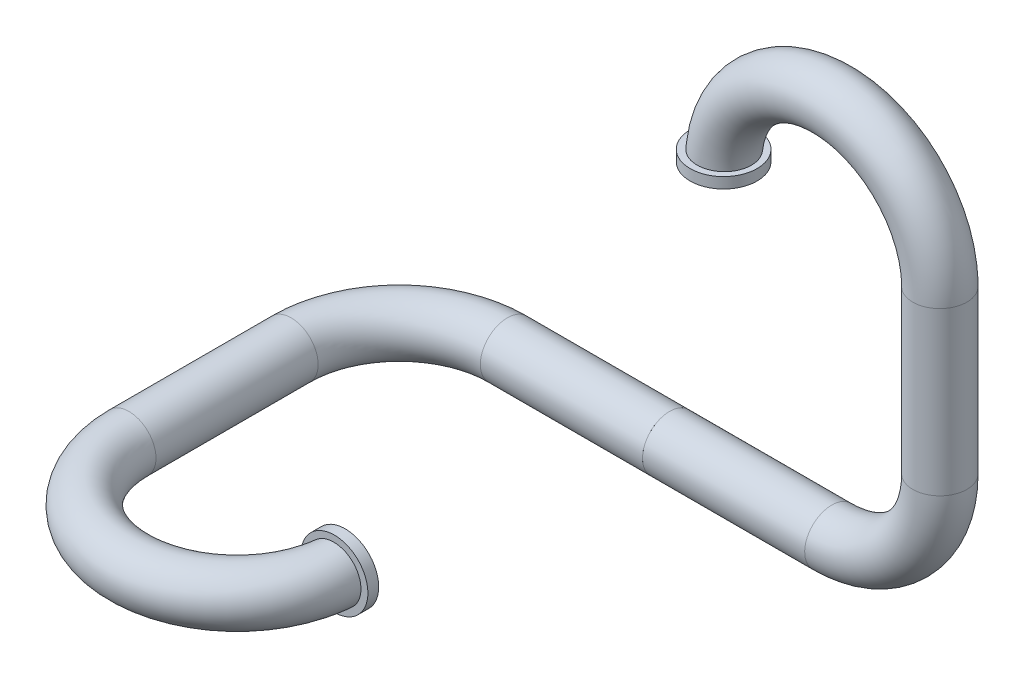
ISO-10303-21;
HEADER;
FILE_DESCRIPTION(('STEP AP214'),'2;1');
FILE_NAME('part.step','',(''),(''),'','','');
FILE_SCHEMA(('AUTOMOTIVE_DESIGN { 1 0 10303 214 1 1 1 1 }'));
ENDSEC;
DATA;
#1=APPLICATION_CONTEXT('core data for automotive mechanical design processes');
#2=APPLICATION_PROTOCOL_DEFINITION('international standard','automotive_design',2000,#1);
#3=PRODUCT_CONTEXT('',#1,'mechanical');
#4=PRODUCT('Part','Part','',(#3));
#5=PRODUCT_RELATED_PRODUCT_CATEGORY('part','',(#4));
#6=PRODUCT_DEFINITION_FORMATION('','',#4);
#7=PRODUCT_DEFINITION_CONTEXT('part definition',#1,'design');
#8=PRODUCT_DEFINITION('design','',#6,#7);
#9=PRODUCT_DEFINITION_SHAPE('','',#8);
#10=(LENGTH_UNIT() NAMED_UNIT(*) SI_UNIT(.MILLI.,.METRE.));
#11=(NAMED_UNIT(*) PLANE_ANGLE_UNIT() SI_UNIT($,.RADIAN.));
#12=(NAMED_UNIT(*) SI_UNIT($,.STERADIAN.) SOLID_ANGLE_UNIT());
#13=UNCERTAINTY_MEASURE_WITH_UNIT(LENGTH_MEASURE(1.E-05),#10,'distance_accuracy_value','');
#14=(GEOMETRIC_REPRESENTATION_CONTEXT(3) GLOBAL_UNCERTAINTY_ASSIGNED_CONTEXT((#13)) GLOBAL_UNIT_ASSIGNED_CONTEXT((#10,
#11,#12)) REPRESENTATION_CONTEXT('',''));
#15=CARTESIAN_POINT('',(0.,0.,0.));
#16=DIRECTION('',(0.,0.,1.));
#17=DIRECTION('',(1.,0.,0.));
#18=AXIS2_PLACEMENT_3D('',#15,#16,#17);
#19=CARTESIAN_POINT('',(0.5,-2.50000000000001,2.5));
#20=DIRECTION('',(1.,0.,0.));
#21=DIRECTION('',(0.,1.,0.));
#22=AXIS2_PLACEMENT_3D('',#19,#20,#21);
#23=PLANE('',#22);
#24=CARTESIAN_POINT('',(0.5,-2.5,0.));
#25=DIRECTION('',(1.,0.,0.));
#26=DIRECTION('',(0.,1.,0.));
#27=AXIS2_PLACEMENT_3D('',#24,#25,#26);
#28=CIRCLE('',#27,0.2);
#29=CARTESIAN_POINT('',(0.5,-2.3,0.));
#30=VERTEX_POINT('',#29);
#31=EDGE_CURVE('E42',#30,#30,#28,.F.);
#32=ORIENTED_EDGE('',*,*,#31,.T.);
#33=EDGE_LOOP('',(#32));
#34=FACE_BOUND('',#33,.T.);
#35=CARTESIAN_POINT('',(0.5,-2.5,0.));
#36=DIRECTION('',(1.,0.,0.));
#37=DIRECTION('',(0.,1.,0.));
#38=AXIS2_PLACEMENT_3D('',#35,#36,#37);
#39=CIRCLE('',#38,0.25);
#40=CARTESIAN_POINT('',(0.5,-2.25,0.));
#41=VERTEX_POINT('',#40);
#42=EDGE_CURVE('E56',#41,#41,#39,.F.);
#43=ORIENTED_EDGE('',*,*,#42,.F.);
#44=EDGE_LOOP('',(#43));
#45=FACE_BOUND('',#44,.T.);
#46=ADVANCED_FACE('F38',(#34,#45),#23,.T.);
#47=CARTESIAN_POINT('',(0.,-2.50000000000001,2.6));
#48=DIRECTION('',(0.,0.,-1.));
#49=DIRECTION('',(0.,1.,0.));
#50=AXIS2_PLACEMENT_3D('',#47,#48,#49);
#51=CYLINDRICAL_SURFACE('',#50,0.31);
#52=CARTESIAN_POINT('',(0.,-2.50000000000001,2.6));
#53=DIRECTION('',(0.,0.,1.));
#54=DIRECTION('',(0.,-1.,0.));
#55=AXIS2_PLACEMENT_3D('',#52,#53,#54);
#56=CIRCLE('',#55,0.31);
#57=CARTESIAN_POINT('',(0.,-2.81000000000001,2.6));
#58=VERTEX_POINT('',#57);
#59=EDGE_CURVE('E46',#58,#58,#56,.T.);
#60=ORIENTED_EDGE('',*,*,#59,.F.);
#61=EDGE_LOOP('',(#60));
#62=FACE_BOUND('',#61,.T.);
#63=CARTESIAN_POINT('',(0.,-2.50000000000001,2.5));
#64=DIRECTION('',(0.,0.,1.));
#65=DIRECTION('',(0.,-1.,0.));
#66=AXIS2_PLACEMENT_3D('',#63,#64,#65);
#67=CIRCLE('',#66,0.31);
#68=CARTESIAN_POINT('',(0.,-2.81000000000001,2.5));
#69=VERTEX_POINT('',#68);
#70=EDGE_CURVE('E11',#69,#69,#67,.T.);
#71=ORIENTED_EDGE('',*,*,#70,.T.);
#72=EDGE_LOOP('',(#71));
#73=FACE_BOUND('',#72,.T.);
#74=ADVANCED_FACE('F82',(#62,#73),#51,.T.);
#75=CARTESIAN_POINT('',(0.,-2.50000000000001,2.6));
#76=DIRECTION('',(0.,0.,1.));
#77=DIRECTION('',(0.,-1.,0.));
#78=AXIS2_PLACEMENT_3D('',#75,#76,#77);
#79=PLANE('',#78);
#80=ORIENTED_EDGE('',*,*,#59,.T.);
#81=EDGE_LOOP('',(#80));
#82=FACE_BOUND('',#81,.T.);
#83=CARTESIAN_POINT('',(-0.201401096317609,-2.34376036206095,2.6));
#84=CARTESIAN_POINT('',(-0.210190615714738,-2.3546555316644,2.6));
#85=CARTESIAN_POINT('',(-0.218071722109463,-2.36629603769943,2.6));
#86=CARTESIAN_POINT('',(-0.231777903107573,-2.39074262085692,2.6));
#87=CARTESIAN_POINT('',(-0.237600690405998,-2.40354997489217,2.6));
#88=CARTESIAN_POINT('',(-0.247007650165607,-2.42996134021037,2.6));
#89=CARTESIAN_POINT('',(-0.250592194362358,-2.44356521879289,2.6));
#90=CARTESIAN_POINT('',(-0.255413188399921,-2.47117935384267,2.6));
#91=CARTESIAN_POINT('',(-0.256650230465359,-2.4851895069098,2.6));
#92=CARTESIAN_POINT('',(-0.25674012956133,-2.51315381103875,2.6));
#93=CARTESIAN_POINT('',(-0.255603761287644,-2.527107928297,2.6));
#94=CARTESIAN_POINT('',(-0.251003172674125,-2.55462721374323,2.6));
#95=CARTESIAN_POINT('',(-0.247538882318156,-2.56819237021977,2.6));
#96=CARTESIAN_POINT('',(-0.238388633745031,-2.59454538926489,2.6));
#97=CARTESIAN_POINT('',(-0.232703487129412,-2.60733353381829,2.6));
#98=CARTESIAN_POINT('',(-0.219279773062284,-2.63178209678148,2.6));
#99=CARTESIAN_POINT('',(-0.211541147629265,-2.64344248333549,2.6));
#100=CARTESIAN_POINT('',(-0.194180832606932,-2.66538311643699,2.6));
#101=CARTESIAN_POINT('',(-0.18454778916345,-2.67565437808356,2.6));
#102=CARTESIAN_POINT('',(-0.163705864908683,-2.69444931498862,2.6));
#103=CARTESIAN_POINT('',(-0.152496920871618,-2.70297292009667,2.6));
#104=CARTESIAN_POINT('',(-0.128727432177818,-2.71809849586688,2.6));
#105=CARTESIAN_POINT('',(-0.116157110459005,-2.72468510480363,2.6));
#106=CARTESIAN_POINT('',(-0.090092558295824,-2.73566542576813,2.6));
#107=CARTESIAN_POINT('',(-0.0765983014200872,-2.7400590750312,2.6));
#108=CARTESIAN_POINT('',(-0.0490037254832951,-2.74654519119286,2.6));
#109=CARTESIAN_POINT('',(-0.0349009697958583,-2.74862729772805,2.6));
#110=CARTESIAN_POINT('',(-0.0065459349688668,-2.75039444716182,2.6));
#111=CARTESIAN_POINT('',(0.00770634481024823,-2.75007947980322,2.6));
#112=CARTESIAN_POINT('',(0.0359552161641339,-2.74705813940225,2.6));
#113=CARTESIAN_POINT('',(0.0499518104184512,-2.74435179143591,2.6));
#114=CARTESIAN_POINT('',(0.0772894135497917,-2.73662047735946,2.6));
#115=CARTESIAN_POINT('',(0.0906304308904238,-2.73159554119144,2.6));
#116=CARTESIAN_POINT('',(0.116234413487642,-2.71938486900645,2.6));
#117=CARTESIAN_POINT('',(0.128500521169367,-2.71220572285242,2.6));
#118=CARTESIAN_POINT('',(0.151646839119026,-2.69588211387219,2.6));
#119=CARTESIAN_POINT('',(0.162527077997131,-2.68673769162805,2.6));
#120=CARTESIAN_POINT('',(0.182546180432526,-2.66678276640518,2.6));
#121=CARTESIAN_POINT('',(0.191691887715395,-2.65597912907339,2.6));
#122=CARTESIAN_POINT('',(0.208031942604488,-2.63298512264845,2.6));
#123=CARTESIAN_POINT('',(0.215226328920527,-2.62079478107121,2.6));
#124=CARTESIAN_POINT('',(0.227433287128235,-2.59542026293881,2.6));
#125=CARTESIAN_POINT('',(0.232453530620286,-2.58223977665941,2.6));
#126=CARTESIAN_POINT('',(0.240204253167929,-2.55522194484153,2.6));
#127=CARTESIAN_POINT('',(0.242934765237328,-2.54138460877667,2.6));
#128=CARTESIAN_POINT('',(0.246023480720513,-2.51347957399531,2.6));
#129=CARTESIAN_POINT('',(0.246387057425578,-2.49941246978034,2.6));
#130=CARTESIAN_POINT('',(0.244745727650856,-2.47141718228088,2.6));
#131=CARTESIAN_POINT('',(0.242740835396257,-2.45748899816253,2.6));
#132=CARTESIAN_POINT('',(0.236422429745385,-2.43017585350137,2.6));
#133=CARTESIAN_POINT('',(0.232110367704181,-2.41679055713653,2.6));
#134=CARTESIAN_POINT('',(0.221302613835048,-2.39093278783442,2.6));
#135=CARTESIAN_POINT('',(0.21480691921559,-2.37846031606413,2.6));
#136=CARTESIAN_POINT('',(0.199809991107809,-2.35476686697339,2.6));
#137=CARTESIAN_POINT('',(0.191306581255811,-2.34354726734438,2.6));
#138=CARTESIAN_POINT('',(0.172541402772618,-2.32269021557873,2.6));
#139=CARTESIAN_POINT('',(0.162279611876264,-2.31305278347899,2.6));
#140=CARTESIAN_POINT('',(0.140260536178512,-2.2956054110259,2.6));
#141=CARTESIAN_POINT('',(0.128499350856914,-2.28780039362167,2.6));
#142=CARTESIAN_POINT('',(0.103837454519992,-2.27426711311745,2.6));
#143=CARTESIAN_POINT('',(0.0909367201277325,-2.26853889263357,2.6));
#144=CARTESIAN_POINT('',(0.0643098227029985,-2.25929834983662,2.6));
#145=CARTESIAN_POINT('',(0.0505807148736024,-2.25579451342965,2.6));
#146=CARTESIAN_POINT('',(0.0227304868784085,-2.25113171827814,2.6));
#147=CARTESIAN_POINT('',(0.00860937300525724,-2.24997272191527,2.6));
#148=CARTESIAN_POINT('',(-0.019682310331464,-2.25002836206515,2.6));
#149=CARTESIAN_POINT('',(-0.033852861838134,-2.25125211594202,2.6));
#150=CARTESIAN_POINT('',(-0.0617929096379456,-2.25605561176457,2.6));
#151=CARTESIAN_POINT('',(-0.0755622983800522,-2.25963597955383,2.6));
#152=CARTESIAN_POINT('',(-0.102345731745449,-2.26906490291857,2.6));
#153=CARTESIAN_POINT('',(-0.115357430686798,-2.27492011201274,2.6));
#154=CARTESIAN_POINT('',(-0.140200186875687,-2.28873081702701,2.6));
#155=CARTESIAN_POINT('',(-0.152032625018917,-2.29668381568912,2.6));
#156=CARTESIAN_POINT('',(-0.170150558895375,-2.31122311793616,2.6));
#157=CARTESIAN_POINT('',(-0.176888616987927,-2.31725492758524,2.6));
#158=CARTESIAN_POINT('',(-0.189677604716015,-2.33000779744646,2.6));
#159=CARTESIAN_POINT('',(-0.195728533355725,-2.33672885865747,2.6));
#160=CARTESIAN_POINT('',(-0.201401096317609,-2.34376036206095,2.6));
#161=B_SPLINE_CURVE_WITH_KNOTS('',3,(#83,#84,#85,#86,#87,#88,#89,#90,#91,#92,#93,#94,#95,#96,
#97,#98,#99,#100,#101,#102,#103,#104,#105,#106,#107,#108,#109,#110,#111,#112,#113,#114,#115,
#116,#117,#118,#119,#120,#121,#122,#123,#124,#125,#126,#127,#128,#129,#130,#131,#132,#133,#134,
#135,#136,#137,#138,#139,#140,#141,#142,#143,#144,#145,#146,#147,#148,#149,#150,#151,#152,#153,
#154,#155,#156,#157,#158,#159,#160),.UNSPECIFIED.,.T.,.F.,(4,2,2,2,2,2,2,2,2,2,2,2,2,2,2,2,2,2,
2,2,2,2,2,2,2,2,2,2,2,2,2,2,2,2,2,2,2,2,4),(0.,0.041963105250393,0.0839726964411995,
0.125975308668973,0.167967323125762,0.209769118662524,0.251572171514233,0.293359961905662,
0.335148932332196,0.377196440897467,0.419245636907758,0.461619835954524,0.503995247723257,
0.54655982933734,0.589124593087473,0.631688910508933,0.6742526782734,0.716687545691694,
0.759121536933535,0.801384450217337,0.843646525038763,0.88575823574167,0.927869339259047,
0.969884810944664,1.01190003028372,1.05388885042508,1.09587772424463,1.13791232469054,
1.17994745743075,1.22209426111071,1.2642419295994,1.30654943795309,1.34885626756106,
1.39132529833847,1.43380561212635,1.47641112039158,1.51896613717817,1.5460481653165,
1.57313023270311),.UNSPECIFIED.);
#162=CARTESIAN_POINT('',(-0.201401096317609,-2.34376036206095,2.6));
#163=VERTEX_POINT('',#162);
#164=EDGE_CURVE('E51',#163,#163,#161,.T.);
#165=ORIENTED_EDGE('',*,*,#164,.F.);
#166=EDGE_LOOP('',(#165));
#167=FACE_BOUND('',#166,.T.);
#168=ADVANCED_FACE('F84',(#82,#167),#79,.T.);
#169=CARTESIAN_POINT('',(-1.,-2.50000000000001,2.5));
#170=DIRECTION('',(0.,1.,0.));
#171=DIRECTION('',(-1.,0.,0.));
#172=AXIS2_PLACEMENT_3D('',#169,#170,#171);
#173=TOROIDAL_SURFACE('',#172,1.,0.25);
#174=ORIENTED_EDGE('',*,*,#164,.T.);
#175=EDGE_LOOP('',(#174));
#176=FACE_BOUND('',#175,.T.);
#177=CARTESIAN_POINT('',(-2.,-2.50000000000001,2.5));
#178=DIRECTION('',(0.,0.,-1.));
#179=DIRECTION('',(1.,0.,0.));
#180=AXIS2_PLACEMENT_3D('',#177,#178,#179);
#181=CIRCLE('',#180,0.25);
#182=CARTESIAN_POINT('',(-1.75,-2.50000000000001,2.5));
#183=VERTEX_POINT('',#182);
#184=EDGE_CURVE('E107',#183,#183,#181,.T.);
#185=ORIENTED_EDGE('',*,*,#184,.F.);
#186=EDGE_LOOP('',(#185));
#187=FACE_BOUND('',#186,.T.);
#188=ADVANCED_FACE('F91',(#176,#187),#173,.T.);
#189=CARTESIAN_POINT('',(-2.,-2.50000000000001,2.5));
#190=DIRECTION('',(0.,0.,-1.));
#191=DIRECTION('',(1.,0.,0.));
#192=AXIS2_PLACEMENT_3D('',#189,#190,#191);
#193=CYLINDRICAL_SURFACE('',#192,0.25);
#194=ORIENTED_EDGE('',*,*,#184,.T.);
#195=EDGE_LOOP('',(#194));
#196=FACE_BOUND('',#195,.T.);
#197=CARTESIAN_POINT('',(-2.,-2.5,1.));
#198=DIRECTION('',(0.,0.,1.));
#199=DIRECTION('',(-1.,0.,0.));
#200=AXIS2_PLACEMENT_3D('',#197,#198,#199);
#201=CIRCLE('',#200,0.25);
#202=CARTESIAN_POINT('',(-2.25,-2.5,1.));
#203=VERTEX_POINT('',#202);
#204=EDGE_CURVE('E62',#203,#203,#201,.F.);
#205=ORIENTED_EDGE('',*,*,#204,.F.);
#206=EDGE_LOOP('',(#205));
#207=FACE_BOUND('',#206,.T.);
#208=ADVANCED_FACE('F112',(#196,#207),#193,.T.);
#209=CARTESIAN_POINT('',(-1.,-2.5,1.));
#210=DIRECTION('',(0.,-1.,0.));
#211=DIRECTION('',(1.,0.,0.));
#212=AXIS2_PLACEMENT_3D('',#209,#210,#211);
#213=TOROIDAL_SURFACE('',#212,1.,0.25);
#214=CARTESIAN_POINT('',(-1.,-2.5,0.));
#215=DIRECTION('',(1.,0.,0.));
#216=DIRECTION('',(0.,0.,1.));
#217=AXIS2_PLACEMENT_3D('',#214,#215,#216);
#218=CIRCLE('',#217,0.25);
#219=CARTESIAN_POINT('',(-1.,-2.5,-0.25));
#220=VERTEX_POINT('',#219);
#221=EDGE_CURVE('E58',#220,#220,#218,.T.);
#222=CARTESIAN_POINT('',(-1.,-2.5,1.));
#223=DIRECTION('',(0.,-1.,0.));
#224=DIRECTION('',(1.,0.,0.));
#225=AXIS2_PLACEMENT_3D('',#222,#223,#224);
#226=CIRCLE('',#225,1.25);
#227=EDGE_CURVE('',#203,#220,#226,.T.);
#228=ORIENTED_EDGE('',*,*,#204,.T.);
#229=ORIENTED_EDGE('',*,*,#221,.F.);
#230=ORIENTED_EDGE('',*,*,#227,.T.);
#231=ORIENTED_EDGE('',*,*,#227,.F.);
#232=EDGE_LOOP('',(#228,#230,#229,#231));
#233=FACE_BOUND('',#232,.T.);
#234=ADVANCED_FACE('F116',(#233),#213,.T.);
#235=CARTESIAN_POINT('',(0.,-2.50000000000001,2.5));
#236=DIRECTION('',(0.,0.,1.));
#237=DIRECTION('',(0.,-1.,0.));
#238=AXIS2_PLACEMENT_3D('',#235,#236,#237);
#239=PLANE('',#238);
#240=CARTESIAN_POINT('',(0.,-2.50000000000001,2.5));
#241=DIRECTION('',(0.,0.,1.));
#242=DIRECTION('',(0.,-1.,0.));
#243=AXIS2_PLACEMENT_3D('',#240,#241,#242);
#244=CIRCLE('',#243,0.2);
#245=CARTESIAN_POINT('',(0.2,-2.50000000000001,2.5));
#246=VERTEX_POINT('',#245);
#247=EDGE_CURVE('E54',#246,#246,#244,.T.);
#248=ORIENTED_EDGE('',*,*,#247,.T.);
#249=EDGE_LOOP('',(#248));
#250=FACE_BOUND('',#249,.T.);
#251=ORIENTED_EDGE('',*,*,#70,.F.);
#252=EDGE_LOOP('',(#251));
#253=FACE_BOUND('',#252,.T.);
#254=ADVANCED_FACE('F120',(#250,#253),#239,.F.);
#255=CARTESIAN_POINT('',(-1.,-2.50000000000001,2.5));
#256=DIRECTION('',(0.,1.,0.));
#257=DIRECTION('',(-1.,0.,0.));
#258=AXIS2_PLACEMENT_3D('',#255,#256,#257);
#259=TOROIDAL_SURFACE('',#258,1.,0.2);
#260=CARTESIAN_POINT('',(-2.,-2.50000000000001,2.5));
#261=DIRECTION('',(0.,0.,-1.));
#262=DIRECTION('',(0.,-1.,0.));
#263=AXIS2_PLACEMENT_3D('',#260,#261,#262);
#264=CIRCLE('',#263,0.2);
#265=CARTESIAN_POINT('',(-2.2,-2.50000000000001,2.5));
#266=VERTEX_POINT('',#265);
#267=EDGE_CURVE('E133',#266,#266,#264,.T.);
#268=CARTESIAN_POINT('',(-1.,-2.50000000000001,2.5));
#269=DIRECTION('',(0.,1.,0.));
#270=DIRECTION('',(-1.,0.,0.));
#271=AXIS2_PLACEMENT_3D('',#268,#269,#270);
#272=CIRCLE('',#271,1.2);
#273=EDGE_CURVE('',#266,#246,#272,.T.);
#274=ORIENTED_EDGE('',*,*,#267,.T.);
#275=ORIENTED_EDGE('',*,*,#247,.F.);
#276=ORIENTED_EDGE('',*,*,#273,.T.);
#277=ORIENTED_EDGE('',*,*,#273,.F.);
#278=EDGE_LOOP('',(#274,#276,#275,#277));
#279=FACE_BOUND('',#278,.T.);
#280=ADVANCED_FACE('F98',(#279),#259,.F.);
#281=CARTESIAN_POINT('',(-2.,-2.50000000000001,2.5));
#282=DIRECTION('',(0.,0.,-1.));
#283=DIRECTION('',(1.,0.,0.));
#284=AXIS2_PLACEMENT_3D('',#281,#282,#283);
#285=CYLINDRICAL_SURFACE('',#284,0.2);
#286=ORIENTED_EDGE('',*,*,#267,.F.);
#287=EDGE_LOOP('',(#286));
#288=FACE_BOUND('',#287,.T.);
#289=CARTESIAN_POINT('',(-2.,-2.5,1.));
#290=DIRECTION('',(0.,0.,-1.));
#291=DIRECTION('',(0.,-1.,0.));
#292=AXIS2_PLACEMENT_3D('',#289,#290,#291);
#293=CIRCLE('',#292,0.2);
#294=CARTESIAN_POINT('',(-2.2,-2.5,1.));
#295=VERTEX_POINT('',#294);
#296=EDGE_CURVE('E136',#295,#295,#293,.T.);
#297=ORIENTED_EDGE('',*,*,#296,.T.);
#298=EDGE_LOOP('',(#297));
#299=FACE_BOUND('',#298,.T.);
#300=ADVANCED_FACE('F78',(#288,#299),#285,.F.);
#301=CARTESIAN_POINT('',(-1.,-2.5,1.));
#302=DIRECTION('',(0.,-1.,0.));
#303=DIRECTION('',(1.,0.,0.));
#304=AXIS2_PLACEMENT_3D('',#301,#302,#303);
#305=TOROIDAL_SURFACE('',#304,1.,0.2);
#306=CARTESIAN_POINT('',(-1.,-2.5,0.));
#307=DIRECTION('',(1.,0.,0.));
#308=DIRECTION('',(0.,-1.,0.));
#309=AXIS2_PLACEMENT_3D('',#306,#307,#308);
#310=CIRCLE('',#309,0.2);
#311=CARTESIAN_POINT('',(-1.,-2.5,-0.2));
#312=VERTEX_POINT('',#311);
#313=EDGE_CURVE('E137',#312,#312,#310,.T.);
#314=CARTESIAN_POINT('',(-1.,-2.5,1.));
#315=DIRECTION('',(0.,-1.,0.));
#316=DIRECTION('',(1.,0.,0.));
#317=AXIS2_PLACEMENT_3D('',#314,#315,#316);
#318=CIRCLE('',#317,1.2);
#319=EDGE_CURVE('',#295,#312,#318,.T.);
#320=ORIENTED_EDGE('',*,*,#296,.F.);
#321=ORIENTED_EDGE('',*,*,#313,.T.);
#322=ORIENTED_EDGE('',*,*,#319,.T.);
#323=ORIENTED_EDGE('',*,*,#319,.F.);
#324=EDGE_LOOP('',(#320,#322,#321,#323));
#325=FACE_BOUND('',#324,.T.);
#326=ADVANCED_FACE('F71',(#325),#305,.F.);
#327=CARTESIAN_POINT('',(-1.,-2.5,0.));
#328=DIRECTION('',(1.,0.,0.));
#329=DIRECTION('',(0.,0.,1.));
#330=AXIS2_PLACEMENT_3D('',#327,#328,#329);
#331=CYLINDRICAL_SURFACE('',#330,0.2);
#332=ORIENTED_EDGE('',*,*,#313,.F.);
#333=EDGE_LOOP('',(#332));
#334=FACE_BOUND('',#333,.T.);
#335=ORIENTED_EDGE('',*,*,#31,.F.);
#336=EDGE_LOOP('',(#335));
#337=FACE_BOUND('',#336,.T.);
#338=ADVANCED_FACE('F40',(#334,#337),#331,.F.);
#339=CARTESIAN_POINT('',(-1.,-2.5,0.));
#340=DIRECTION('',(1.,0.,0.));
#341=DIRECTION('',(0.,0.,1.));
#342=AXIS2_PLACEMENT_3D('',#339,#340,#341);
#343=CYLINDRICAL_SURFACE('',#342,0.25);
#344=ORIENTED_EDGE('',*,*,#221,.T.);
#345=EDGE_LOOP('',(#344));
#346=FACE_BOUND('',#345,.T.);
#347=ORIENTED_EDGE('',*,*,#42,.T.);
#348=EDGE_LOOP('',(#347));
#349=FACE_BOUND('',#348,.T.);
#350=ADVANCED_FACE('F70',(#346,#349),#343,.T.);
#351=CLOSED_SHELL('',(#46,#74,#168,#188,#208,#234,#254,#280,#300,#326,#338,#350));
#352=MANIFOLD_SOLID_BREP('B2',#351);
#353=CARTESIAN_POINT('',(0.5,0.,0.));
#354=DIRECTION('',(1.,0.,0.));
#355=DIRECTION('',(0.,0.,-1.));
#356=AXIS2_PLACEMENT_3D('',#353,#354,#355);
#357=PLANE('',#356);
#358=CARTESIAN_POINT('',(0.5,-2.5,0.));
#359=DIRECTION('',(1.,0.,0.));
#360=DIRECTION('',(0.,0.,-1.));
#361=AXIS2_PLACEMENT_3D('',#358,#359,#360);
#362=CIRCLE('',#361,0.25);
#363=CARTESIAN_POINT('',(0.5,-2.5,-0.25));
#364=VERTEX_POINT('',#363);
#365=EDGE_CURVE('E37',#364,#364,#362,.F.);
#366=ORIENTED_EDGE('',*,*,#365,.T.);
#367=EDGE_LOOP('',(#366));
#368=FACE_BOUND('',#367,.T.);
#369=CARTESIAN_POINT('',(0.5,-2.5,0.));
#370=DIRECTION('',(1.,0.,0.));
#371=DIRECTION('',(0.,0.,-1.));
#372=AXIS2_PLACEMENT_3D('',#369,#370,#371);
#373=CIRCLE('',#372,0.2);
#374=CARTESIAN_POINT('',(0.5,-2.5,-0.2));
#375=VERTEX_POINT('',#374);
#376=EDGE_CURVE('E238',#375,#375,#373,.F.);
#377=ORIENTED_EDGE('',*,*,#376,.F.);
#378=EDGE_LOOP('',(#377));
#379=FACE_BOUND('',#378,.T.);
#380=ADVANCED_FACE('F232',(#368,#379),#357,.F.);
#381=CARTESIAN_POINT('',(-1.,-2.5,0.));
#382=DIRECTION('',(1.,0.,0.));
#383=DIRECTION('',(0.,1.,0.));
#384=AXIS2_PLACEMENT_3D('',#381,#382,#383);
#385=CYLINDRICAL_SURFACE('',#384,0.25);
#386=ORIENTED_EDGE('',*,*,#365,.F.);
#387=EDGE_LOOP('',(#386));
#388=FACE_BOUND('',#387,.T.);
#389=CARTESIAN_POINT('',(2.,-2.5,0.));
#390=DIRECTION('',(1.,0.,0.));
#391=DIRECTION('',(0.,1.,0.));
#392=AXIS2_PLACEMENT_3D('',#389,#390,#391);
#393=CIRCLE('',#392,0.25);
#394=CARTESIAN_POINT('',(2.,-2.75,0.));
#395=VERTEX_POINT('',#394);
#396=EDGE_CURVE('E242',#395,#395,#393,.T.);
#397=ORIENTED_EDGE('',*,*,#396,.F.);
#398=EDGE_LOOP('',(#397));
#399=FACE_BOUND('',#398,.T.);
#400=ADVANCED_FACE('F275',(#388,#399),#385,.T.);
#401=CARTESIAN_POINT('',(1.,0.,0.));
#402=DIRECTION('',(0.,1.,0.));
#403=DIRECTION('',(0.,0.,1.));
#404=AXIS2_PLACEMENT_3D('',#401,#402,#403);
#405=PLANE('',#404);
#406=CARTESIAN_POINT('',(1.,0.,0.));
#407=DIRECTION('',(0.,-1.,0.));
#408=DIRECTION('',(0.,0.,1.));
#409=AXIS2_PLACEMENT_3D('',#406,#407,#408);
#410=CIRCLE('',#409,0.2);
#411=CARTESIAN_POINT('',(0.800000000000001,0.,0.));
#412=VERTEX_POINT('',#411);
#413=EDGE_CURVE('E256',#412,#412,#410,.T.);
#414=ORIENTED_EDGE('',*,*,#413,.F.);
#415=EDGE_LOOP('',(#414));
#416=FACE_BOUND('',#415,.T.);
#417=CARTESIAN_POINT('',(1.,0.,0.));
#418=DIRECTION('',(0.,-1.,0.));
#419=DIRECTION('',(0.,0.,1.));
#420=AXIS2_PLACEMENT_3D('',#417,#418,#419);
#421=CIRCLE('',#420,0.31);
#422=CARTESIAN_POINT('',(1.,0.,0.31));
#423=VERTEX_POINT('',#422);
#424=EDGE_CURVE('E319',#423,#423,#421,.T.);
#425=ORIENTED_EDGE('',*,*,#424,.T.);
#426=EDGE_LOOP('',(#425));
#427=FACE_BOUND('',#426,.T.);
#428=ADVANCED_FACE('F277',(#416,#427),#405,.F.);
#429=CARTESIAN_POINT('',(2.,0.,0.));
#430=DIRECTION('',(0.,0.,-1.));
#431=DIRECTION('',(1.,0.,0.));
#432=AXIS2_PLACEMENT_3D('',#429,#430,#431);
#433=TOROIDAL_SURFACE('',#432,1.,0.2);
#434=CARTESIAN_POINT('',(3.,0.,0.));
#435=DIRECTION('',(0.,1.,0.));
#436=DIRECTION('',(0.,0.,1.));
#437=AXIS2_PLACEMENT_3D('',#434,#435,#436);
#438=CIRCLE('',#437,0.2);
#439=CARTESIAN_POINT('',(3.2,0.,0.));
#440=VERTEX_POINT('',#439);
#441=EDGE_CURVE('E326',#440,#440,#438,.T.);
#442=CARTESIAN_POINT('',(2.,0.,0.));
#443=DIRECTION('',(0.,0.,-1.));
#444=DIRECTION('',(1.,0.,0.));
#445=AXIS2_PLACEMENT_3D('',#442,#443,#444);
#446=CIRCLE('',#445,1.2);
#447=EDGE_CURVE('',#412,#440,#446,.T.);
#448=ORIENTED_EDGE('',*,*,#413,.T.);
#449=ORIENTED_EDGE('',*,*,#441,.F.);
#450=ORIENTED_EDGE('',*,*,#447,.T.);
#451=ORIENTED_EDGE('',*,*,#447,.F.);
#452=EDGE_LOOP('',(#448,#450,#449,#451));
#453=FACE_BOUND('',#452,.T.);
#454=ADVANCED_FACE('F284',(#453),#433,.F.);
#455=CARTESIAN_POINT('',(3.,0.,0.));
#456=DIRECTION('',(0.,-1.,0.));
#457=DIRECTION('',(-1.,0.,0.));
#458=AXIS2_PLACEMENT_3D('',#455,#456,#457);
#459=CYLINDRICAL_SURFACE('',#458,0.2);
#460=ORIENTED_EDGE('',*,*,#441,.T.);
#461=EDGE_LOOP('',(#460));
#462=FACE_BOUND('',#461,.T.);
#463=CARTESIAN_POINT('',(3.,-1.5,0.));
#464=DIRECTION('',(0.,1.,0.));
#465=DIRECTION('',(0.,0.,1.));
#466=AXIS2_PLACEMENT_3D('',#463,#464,#465);
#467=CIRCLE('',#466,0.2);
#468=CARTESIAN_POINT('',(3.2,-1.5,0.));
#469=VERTEX_POINT('',#468);
#470=EDGE_CURVE('E329',#469,#469,#467,.T.);
#471=ORIENTED_EDGE('',*,*,#470,.F.);
#472=EDGE_LOOP('',(#471));
#473=FACE_BOUND('',#472,.T.);
#474=ADVANCED_FACE('F300',(#462,#473),#459,.F.);
#475=CARTESIAN_POINT('',(2.,-1.5,0.));
#476=DIRECTION('',(0.,0.,1.));
#477=DIRECTION('',(-1.,0.,0.));
#478=AXIS2_PLACEMENT_3D('',#475,#476,#477);
#479=TOROIDAL_SURFACE('',#478,1.,0.2);
#480=CARTESIAN_POINT('',(2.,-2.5,0.));
#481=DIRECTION('',(1.,0.,0.));
#482=DIRECTION('',(0.,0.,1.));
#483=AXIS2_PLACEMENT_3D('',#480,#481,#482);
#484=CIRCLE('',#483,0.2);
#485=CARTESIAN_POINT('',(2.,-2.7,0.));
#486=VERTEX_POINT('',#485);
#487=EDGE_CURVE('E332',#486,#486,#484,.T.);
#488=CARTESIAN_POINT('',(2.,-1.5,0.));
#489=DIRECTION('',(0.,0.,1.));
#490=DIRECTION('',(-1.,0.,0.));
#491=AXIS2_PLACEMENT_3D('',#488,#489,#490);
#492=CIRCLE('',#491,1.2);
#493=EDGE_CURVE('',#486,#469,#492,.T.);
#494=ORIENTED_EDGE('',*,*,#487,.F.);
#495=ORIENTED_EDGE('',*,*,#470,.T.);
#496=ORIENTED_EDGE('',*,*,#493,.T.);
#497=ORIENTED_EDGE('',*,*,#493,.F.);
#498=EDGE_LOOP('',(#494,#496,#495,#497));
#499=FACE_BOUND('',#498,.T.);
#500=ADVANCED_FACE('F274',(#499),#479,.F.);
#501=CARTESIAN_POINT('',(-1.,-2.5,0.));
#502=DIRECTION('',(1.,0.,0.));
#503=DIRECTION('',(0.,1.,0.));
#504=AXIS2_PLACEMENT_3D('',#501,#502,#503);
#505=CYLINDRICAL_SURFACE('',#504,0.2);
#506=ORIENTED_EDGE('',*,*,#376,.T.);
#507=EDGE_LOOP('',(#506));
#508=FACE_BOUND('',#507,.T.);
#509=ORIENTED_EDGE('',*,*,#487,.T.);
#510=EDGE_LOOP('',(#509));
#511=FACE_BOUND('',#510,.T.);
#512=ADVANCED_FACE('F271',(#508,#511),#505,.F.);
#513=CARTESIAN_POINT('',(1.,0.0999999999999996,0.));
#514=DIRECTION('',(0.,-1.,0.));
#515=DIRECTION('',(0.,0.,-1.));
#516=AXIS2_PLACEMENT_3D('',#513,#514,#515);
#517=CYLINDRICAL_SURFACE('',#516,0.31);
#518=CARTESIAN_POINT('',(1.,0.0999999999999996,0.));
#519=DIRECTION('',(0.,-1.,0.));
#520=DIRECTION('',(0.,0.,1.));
#521=AXIS2_PLACEMENT_3D('',#518,#519,#520);
#522=CIRCLE('',#521,0.31);
#523=CARTESIAN_POINT('',(1.,0.0999999999999996,0.31));
#524=VERTEX_POINT('',#523);
#525=EDGE_CURVE('E257',#524,#524,#522,.T.);
#526=ORIENTED_EDGE('',*,*,#525,.T.);
#527=EDGE_LOOP('',(#526));
#528=FACE_BOUND('',#527,.T.);
#529=ORIENTED_EDGE('',*,*,#424,.F.);
#530=EDGE_LOOP('',(#529));
#531=FACE_BOUND('',#530,.T.);
#532=ADVANCED_FACE('F273',(#528,#531),#517,.T.);
#533=CARTESIAN_POINT('',(1.,0.0999999999999996,0.));
#534=DIRECTION('',(0.,1.,0.));
#535=DIRECTION('',(0.,0.,1.));
#536=AXIS2_PLACEMENT_3D('',#533,#534,#535);
#537=PLANE('',#536);
#538=ORIENTED_EDGE('',*,*,#525,.F.);
#539=EDGE_LOOP('',(#538));
#540=FACE_BOUND('',#539,.T.);
#541=CARTESIAN_POINT('',(1.20140109631761,0.0999999999999994,-0.156239637939055));
#542=CARTESIAN_POINT('',(1.21019061571474,0.0999999999999994,-0.145344468335609));
#543=CARTESIAN_POINT('',(1.21807172210946,0.0999999999999994,-0.133703962300581));
#544=CARTESIAN_POINT('',(1.23177790310757,0.0999999999999994,-0.109257379143088));
#545=CARTESIAN_POINT('',(1.237600690406,0.0999999999999994,-0.096450025107835));
#546=CARTESIAN_POINT('',(1.24700765016561,0.0999999999999994,-0.0700386597896411));
#547=CARTESIAN_POINT('',(1.25059219436236,0.0999999999999994,-0.0564347812071185));
#548=CARTESIAN_POINT('',(1.25541318839992,0.0999999999999994,-0.0288206461573356));
#549=CARTESIAN_POINT('',(1.25665023046536,0.0999999999999994,-0.014810493090211));
#550=CARTESIAN_POINT('',(1.25674012956133,0.0999999999999994,0.0131538110387401));
#551=CARTESIAN_POINT('',(1.25560376128764,0.0999999999999994,0.0271079282969863));
#552=CARTESIAN_POINT('',(1.25100317267413,0.0999999999999994,0.0546272137432173));
#553=CARTESIAN_POINT('',(1.24753888231816,0.0999999999999994,0.0681923702197628));
#554=CARTESIAN_POINT('',(1.23838863374503,0.0999999999999994,0.0945453892648773));
#555=CARTESIAN_POINT('',(1.23270348712941,0.0999999999999994,0.107333533818285));
#556=CARTESIAN_POINT('',(1.21927977306228,0.0999999999999994,0.131782096781474));
#557=CARTESIAN_POINT('',(1.21154114762927,0.0999999999999994,0.143442483335476));
#558=CARTESIAN_POINT('',(1.19418083260693,0.0999999999999995,0.16538311643698));
#559=CARTESIAN_POINT('',(1.18454778916345,0.0999999999999995,0.175654378083549));
#560=CARTESIAN_POINT('',(1.16370586490868,0.0999999999999995,0.194449314988614));
#561=CARTESIAN_POINT('',(1.15249692087162,0.0999999999999995,0.202972920096664));
#562=CARTESIAN_POINT('',(1.12872743217782,0.0999999999999995,0.218098495866874));
#563=CARTESIAN_POINT('',(1.11615711045901,0.0999999999999995,0.224685104803622));
#564=CARTESIAN_POINT('',(1.09009255829582,0.0999999999999995,0.235665425768117));
#565=CARTESIAN_POINT('',(1.07659830142009,0.0999999999999995,0.240059075031189));
#566=CARTESIAN_POINT('',(1.0490037254833,0.0999999999999996,0.246545191192852));
#567=CARTESIAN_POINT('',(1.03490096979586,0.0999999999999996,0.248627297728038));
#568=CARTESIAN_POINT('',(1.00654593496887,0.0999999999999996,0.250394447161815));
#569=CARTESIAN_POINT('',(0.992293655189753,0.0999999999999996,0.250079479803207));
#570=CARTESIAN_POINT('',(0.964044783835867,0.0999999999999996,0.247058139402245));
#571=CARTESIAN_POINT('',(0.95004818958155,0.0999999999999996,0.244351791435899));
#572=CARTESIAN_POINT('',(0.922710586450209,0.0999999999999997,0.236620477359455));
#573=CARTESIAN_POINT('',(0.909369569109577,0.0999999999999997,0.23159554119143));
#574=CARTESIAN_POINT('',(0.883765586512359,0.0999999999999997,0.219384869006445));
#575=CARTESIAN_POINT('',(0.871499478830634,0.0999999999999997,0.212205722852414));
#576=CARTESIAN_POINT('',(0.848353160880975,0.0999999999999997,0.195882113872184));
#577=CARTESIAN_POINT('',(0.837472922002869,0.0999999999999997,0.186737691628039));
#578=CARTESIAN_POINT('',(0.817453819567474,0.0999999999999997,0.166782766405174));
#579=CARTESIAN_POINT('',(0.808308112284606,0.0999999999999997,0.155979129073377));
#580=CARTESIAN_POINT('',(0.791968057395513,0.0999999999999998,0.132985122648441));
#581=CARTESIAN_POINT('',(0.784773671079474,0.0999999999999998,0.120794781071202));
#582=CARTESIAN_POINT('',(0.772566712871766,0.0999999999999998,0.095420262938804));
#583=CARTESIAN_POINT('',(0.767546469379715,0.0999999999999998,0.0822397766594054));
#584=CARTESIAN_POINT('',(0.759795746832072,0.0999999999999998,0.0552219448415193));
#585=CARTESIAN_POINT('',(0.757065234762672,0.0999999999999998,0.0413846087766634));
#586=CARTESIAN_POINT('',(0.753976519279488,0.0999999999999998,0.013479573995303));
#587=CARTESIAN_POINT('',(0.753612942574423,0.0999999999999998,-0.000587530219673126));
#588=CARTESIAN_POINT('',(0.755254272349145,0.0999999999999998,-0.0285828177191339));
#589=CARTESIAN_POINT('',(0.757259164603744,0.0999999999999998,-0.0425110018374756));
#590=CARTESIAN_POINT('',(0.763577570254616,0.0999999999999998,-0.069824146498636));
#591=CARTESIAN_POINT('',(0.76788963229582,0.0999999999999998,-0.0832094428634802));
#592=CARTESIAN_POINT('',(0.778697386164953,0.0999999999999998,-0.109067212165587));
#593=CARTESIAN_POINT('',(0.785193080784411,0.0999999999999998,-0.121539683935882));
#594=CARTESIAN_POINT('',(0.800190008892191,0.0999999999999997,-0.145233133026621));
#595=CARTESIAN_POINT('',(0.808693418744189,0.0999999999999997,-0.156452732655624));
#596=CARTESIAN_POINT('',(0.827458597227383,0.0999999999999997,-0.177309784421281));
#597=CARTESIAN_POINT('',(0.837720388123736,0.0999999999999997,-0.18694721652102));
#598=CARTESIAN_POINT('',(0.859739463821489,0.0999999999999997,-0.20439458897411));
#599=CARTESIAN_POINT('',(0.871500649143087,0.0999999999999997,-0.212199606378334));
#600=CARTESIAN_POINT('',(0.896162545480009,0.0999999999999997,-0.225732886882564));
#601=CARTESIAN_POINT('',(0.909063279872268,0.0999999999999997,-0.231461107366438));
#602=CARTESIAN_POINT('',(0.935690177297002,0.0999999999999997,-0.240701650163389));
#603=CARTESIAN_POINT('',(0.949419285126398,0.0999999999999996,-0.244205486570355));
#604=CARTESIAN_POINT('',(0.977269513121592,0.0999999999999996,-0.248868281721869));
#605=CARTESIAN_POINT('',(0.991390626994743,0.0999999999999996,-0.250027278084741));
#606=CARTESIAN_POINT('',(1.01968231033146,0.0999999999999996,-0.249971637934856));
#607=CARTESIAN_POINT('',(1.03385286183813,0.0999999999999996,-0.248747884057992));
#608=CARTESIAN_POINT('',(1.06179290963795,0.0999999999999995,-0.243944388235435));
#609=CARTESIAN_POINT('',(1.07556229838005,0.0999999999999995,-0.240364020446176));
#610=CARTESIAN_POINT('',(1.10234573174545,0.0999999999999995,-0.230935097081438));
#611=CARTESIAN_POINT('',(1.1153574306868,0.0999999999999995,-0.225079887987269));
#612=CARTESIAN_POINT('',(1.14020018687569,0.0999999999999995,-0.211269182973001));
#613=CARTESIAN_POINT('',(1.15203262501892,0.0999999999999995,-0.203316184310893));
#614=CARTESIAN_POINT('',(1.17015055889538,0.0999999999999995,-0.188776882063845));
#615=CARTESIAN_POINT('',(1.17688861698793,0.0999999999999995,-0.182745072414765));
#616=CARTESIAN_POINT('',(1.18967760471602,0.0999999999999995,-0.169992202553551));
#617=CARTESIAN_POINT('',(1.19572853335573,0.0999999999999994,-0.163271141342544));
#618=CARTESIAN_POINT('',(1.20140109631761,0.0999999999999994,-0.156239637939055));
#619=B_SPLINE_CURVE_WITH_KNOTS('',3,(#541,#542,#543,#544,#545,#546,#547,#548,#549,#550,#551,
#552,#553,#554,#555,#556,#557,#558,#559,#560,#561,#562,#563,#564,#565,#566,#567,#568,#569,#570,
#571,#572,#573,#574,#575,#576,#577,#578,#579,#580,#581,#582,#583,#584,#585,#586,#587,#588,#589,
#590,#591,#592,#593,#594,#595,#596,#597,#598,#599,#600,#601,#602,#603,#604,#605,#606,#607,#608,
#609,#610,#611,#612,#613,#614,#615,#616,#617,#618),.UNSPECIFIED.,.T.,.F.,(4,2,2,2,2,2,2,2,2,2,2,
2,2,2,2,2,2,2,2,2,2,2,2,2,2,2,2,2,2,2,2,2,2,2,2,2,2,2,4),(0.,0.0419631052503928,
0.0839726964411998,0.125975308668973,0.167967323125762,0.209769118662524,0.251572171514233,
0.293359961905662,0.335148932332196,0.377196440897467,0.419245636907758,0.461619835954524,
0.503995247723258,0.54655982933734,0.589124593087474,0.631688910508933,0.6742526782734,
0.716687545691694,0.759121536933536,0.801384450217337,0.843646525038764,0.88575823574167,
0.927869339259047,0.969884810944665,1.01190003028372,1.05388885042508,1.09587772424463,
1.13791232469054,1.17994745743075,1.22209426111071,1.26424192959939,1.30654943795309,
1.34885626756105,1.39132529833847,1.43380561212635,1.47641112039157,1.51896613717817,
1.5460481653165,1.57313023270311),.UNSPECIFIED.);
#620=CARTESIAN_POINT('',(1.20140109631761,0.0999999999999994,-0.156239637939055));
#621=VERTEX_POINT('',#620);
#622=EDGE_CURVE('E249',#621,#621,#619,.T.);
#623=ORIENTED_EDGE('',*,*,#622,.T.);
#624=EDGE_LOOP('',(#623));
#625=FACE_BOUND('',#624,.T.);
#626=ADVANCED_FACE('F260',(#540,#625),#537,.T.);
#627=CARTESIAN_POINT('',(2.,0.,0.));
#628=DIRECTION('',(0.,0.,-1.));
#629=DIRECTION('',(1.,0.,0.));
#630=AXIS2_PLACEMENT_3D('',#627,#628,#629);
#631=TOROIDAL_SURFACE('',#630,1.,0.25);
#632=ORIENTED_EDGE('',*,*,#622,.F.);
#633=EDGE_LOOP('',(#632));
#634=FACE_BOUND('',#633,.T.);
#635=CARTESIAN_POINT('',(3.,0.,0.));
#636=DIRECTION('',(0.,1.,0.));
#637=DIRECTION('',(-1.,0.,0.));
#638=AXIS2_PLACEMENT_3D('',#635,#636,#637);
#639=CIRCLE('',#638,0.25);
#640=CARTESIAN_POINT('',(2.75,0.,0.));
#641=VERTEX_POINT('',#640);
#642=EDGE_CURVE('E258',#641,#641,#639,.T.);
#643=ORIENTED_EDGE('',*,*,#642,.T.);
#644=EDGE_LOOP('',(#643));
#645=FACE_BOUND('',#644,.T.);
#646=ADVANCED_FACE('F263',(#634,#645),#631,.T.);
#647=CARTESIAN_POINT('',(3.,0.,0.));
#648=DIRECTION('',(0.,-1.,0.));
#649=DIRECTION('',(-1.,0.,0.));
#650=AXIS2_PLACEMENT_3D('',#647,#648,#649);
#651=CYLINDRICAL_SURFACE('',#650,0.25);
#652=ORIENTED_EDGE('',*,*,#642,.F.);
#653=EDGE_LOOP('',(#652));
#654=FACE_BOUND('',#653,.T.);
#655=CARTESIAN_POINT('',(3.,-1.5,0.));
#656=DIRECTION('',(0.,-1.,0.));
#657=DIRECTION('',(1.,0.,0.));
#658=AXIS2_PLACEMENT_3D('',#655,#656,#657);
#659=CIRCLE('',#658,0.25);
#660=CARTESIAN_POINT('',(3.25,-1.5,0.));
#661=VERTEX_POINT('',#660);
#662=EDGE_CURVE('E246',#661,#661,#659,.F.);
#663=ORIENTED_EDGE('',*,*,#662,.T.);
#664=EDGE_LOOP('',(#663));
#665=FACE_BOUND('',#664,.T.);
#666=ADVANCED_FACE('F268',(#654,#665),#651,.T.);
#667=CARTESIAN_POINT('',(2.,-1.5,0.));
#668=DIRECTION('',(0.,0.,1.));
#669=DIRECTION('',(-1.,0.,0.));
#670=AXIS2_PLACEMENT_3D('',#667,#668,#669);
#671=TOROIDAL_SURFACE('',#670,1.,0.25);
#672=CARTESIAN_POINT('',(2.,-1.5,0.));
#673=DIRECTION('',(0.,0.,1.));
#674=DIRECTION('',(-1.,0.,0.));
#675=AXIS2_PLACEMENT_3D('',#672,#673,#674);
#676=CIRCLE('',#675,1.25);
#677=EDGE_CURVE('',#395,#661,#676,.T.);
#678=ORIENTED_EDGE('',*,*,#396,.T.);
#679=ORIENTED_EDGE('',*,*,#662,.F.);
#680=ORIENTED_EDGE('',*,*,#677,.T.);
#681=ORIENTED_EDGE('',*,*,#677,.F.);
#682=EDGE_LOOP('',(#678,#680,#679,#681));
#683=FACE_BOUND('',#682,.T.);
#684=ADVANCED_FACE('F279',(#683),#671,.T.);
#685=CLOSED_SHELL('',(#380,#400,#428,#454,#474,#500,#512,#532,#626,#646,#666,#684));
#686=MANIFOLD_SOLID_BREP('B6',#685);
#687=ADVANCED_BREP_SHAPE_REPRESENTATION('',(#18,#352,#686),#14);
#688=SHAPE_DEFINITION_REPRESENTATION(#9,#687);
ENDSEC;
END-ISO-10303-21;
